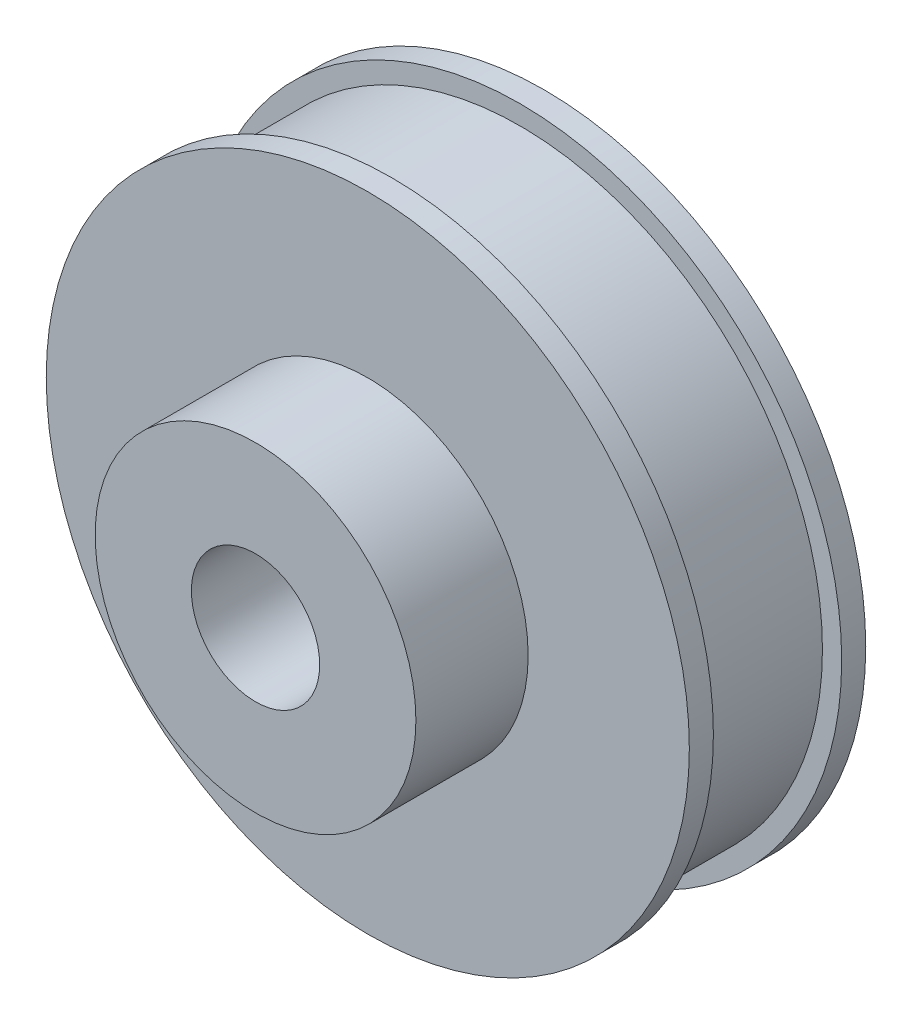
ISO-10303-21;
HEADER;
FILE_DESCRIPTION(('STEP AP214'),'2;1');
FILE_NAME('part.step','',(''),(''),'','','');
FILE_SCHEMA(('AUTOMOTIVE_DESIGN { 1 0 10303 214 1 1 1 1 }'));
ENDSEC;
DATA;
#1=APPLICATION_CONTEXT('core data for automotive mechanical design processes');
#2=APPLICATION_PROTOCOL_DEFINITION('international standard','automotive_design',2000,#1);
#3=PRODUCT_CONTEXT('',#1,'mechanical');
#4=PRODUCT('Part','Part','',(#3));
#5=PRODUCT_RELATED_PRODUCT_CATEGORY('part','',(#4));
#6=PRODUCT_DEFINITION_FORMATION('','',#4);
#7=PRODUCT_DEFINITION_CONTEXT('part definition',#1,'design');
#8=PRODUCT_DEFINITION('design','',#6,#7);
#9=PRODUCT_DEFINITION_SHAPE('','',#8);
#10=(LENGTH_UNIT() NAMED_UNIT(*) SI_UNIT(.MILLI.,.METRE.));
#11=(NAMED_UNIT(*) PLANE_ANGLE_UNIT() SI_UNIT($,.RADIAN.));
#12=(NAMED_UNIT(*) SI_UNIT($,.STERADIAN.) SOLID_ANGLE_UNIT());
#13=UNCERTAINTY_MEASURE_WITH_UNIT(LENGTH_MEASURE(1.E-05),#10,'distance_accuracy_value','');
#14=(GEOMETRIC_REPRESENTATION_CONTEXT(3) GLOBAL_UNCERTAINTY_ASSIGNED_CONTEXT((#13)) GLOBAL_UNIT_ASSIGNED_CONTEXT((#10,
#11,#12)) REPRESENTATION_CONTEXT('',''));
#15=CARTESIAN_POINT('',(0.,0.,0.));
#16=DIRECTION('',(0.,0.,1.));
#17=DIRECTION('',(1.,0.,0.));
#18=AXIS2_PLACEMENT_3D('',#15,#16,#17);
#19=CARTESIAN_POINT('',(0.,0.,11.));
#20=DIRECTION('',(0.,0.,-1.));
#21=DIRECTION('',(-1.,0.,0.));
#22=AXIS2_PLACEMENT_3D('',#19,#20,#21);
#23=CYLINDRICAL_SURFACE('',#22,18.85);
#24=CARTESIAN_POINT('',(0.,0.,1.5));
#25=DIRECTION('',(0.,0.,1.));
#26=DIRECTION('',(1.,0.,0.));
#27=AXIS2_PLACEMENT_3D('',#24,#25,#26);
#28=CIRCLE('',#27,18.85);
#29=CARTESIAN_POINT('',(18.85,0.,1.5));
#30=VERTEX_POINT('',#29);
#31=EDGE_CURVE('E46',#30,#30,#28,.T.);
#32=ORIENTED_EDGE('',*,*,#31,.T.);
#33=EDGE_LOOP('',(#32));
#34=FACE_BOUND('',#33,.T.);
#35=CARTESIAN_POINT('',(0.,0.,9.5));
#36=DIRECTION('',(0.,0.,1.));
#37=DIRECTION('',(1.,0.,0.));
#38=AXIS2_PLACEMENT_3D('',#35,#36,#37);
#39=CIRCLE('',#38,18.85);
#40=CARTESIAN_POINT('',(18.85,0.,9.5));
#41=VERTEX_POINT('',#40);
#42=EDGE_CURVE('E10',#41,#41,#39,.T.);
#43=ORIENTED_EDGE('',*,*,#42,.F.);
#44=EDGE_LOOP('',(#43));
#45=FACE_BOUND('',#44,.T.);
#46=ADVANCED_FACE('F32',(#34,#45),#23,.T.);
#47=CARTESIAN_POINT('',(0.,0.,11.));
#48=DIRECTION('',(0.,0.,-1.));
#49=DIRECTION('',(-1.,0.,0.));
#50=AXIS2_PLACEMENT_3D('',#47,#48,#49);
#51=CYLINDRICAL_SURFACE('',#50,4.);
#52=CARTESIAN_POINT('',(0.,0.,0.));
#53=DIRECTION('',(0.,0.,1.));
#54=DIRECTION('',(1.,0.,0.));
#55=AXIS2_PLACEMENT_3D('',#52,#53,#54);
#56=CIRCLE('',#55,4.);
#57=CARTESIAN_POINT('',(4.,0.,0.));
#58=VERTEX_POINT('',#57);
#59=EDGE_CURVE('E38',#58,#58,#56,.T.);
#60=ORIENTED_EDGE('',*,*,#59,.F.);
#61=EDGE_LOOP('',(#60));
#62=FACE_BOUND('',#61,.T.);
#63=CARTESIAN_POINT('',(0.,0.,18.));
#64=DIRECTION('',(0.,0.,1.));
#65=DIRECTION('',(1.,0.,0.));
#66=AXIS2_PLACEMENT_3D('',#63,#64,#65);
#67=CIRCLE('',#66,4.);
#68=CARTESIAN_POINT('',(4.,0.,18.));
#69=VERTEX_POINT('',#68);
#70=EDGE_CURVE('E66',#69,#69,#67,.T.);
#71=ORIENTED_EDGE('',*,*,#70,.T.);
#72=EDGE_LOOP('',(#71));
#73=FACE_BOUND('',#72,.T.);
#74=ADVANCED_FACE('F70',(#62,#73),#51,.F.);
#75=CARTESIAN_POINT('',(0.,0.,11.));
#76=DIRECTION('',(0.,0.,1.));
#77=DIRECTION('',(1.,0.,0.));
#78=AXIS2_PLACEMENT_3D('',#75,#76,#77);
#79=PLANE('',#78);
#80=CARTESIAN_POINT('',(0.,0.,11.));
#81=DIRECTION('',(0.,0.,1.));
#82=DIRECTION('',(1.,0.,0.));
#83=AXIS2_PLACEMENT_3D('',#80,#81,#82);
#84=CIRCLE('',#83,10.);
#85=CARTESIAN_POINT('',(10.,0.,11.));
#86=VERTEX_POINT('',#85);
#87=EDGE_CURVE('E58',#86,#86,#84,.F.);
#88=ORIENTED_EDGE('',*,*,#87,.T.);
#89=EDGE_LOOP('',(#88));
#90=FACE_BOUND('',#89,.T.);
#91=CARTESIAN_POINT('',(0.,0.,11.));
#92=DIRECTION('',(0.,0.,1.));
#93=DIRECTION('',(1.,0.,0.));
#94=AXIS2_PLACEMENT_3D('',#91,#92,#93);
#95=CIRCLE('',#94,20.05);
#96=CARTESIAN_POINT('',(20.05,0.,11.));
#97=VERTEX_POINT('',#96);
#98=EDGE_CURVE('E55',#97,#97,#95,.T.);
#99=ORIENTED_EDGE('',*,*,#98,.T.);
#100=EDGE_LOOP('',(#99));
#101=FACE_BOUND('',#100,.T.);
#102=ADVANCED_FACE('F94',(#90,#101),#79,.T.);
#103=CARTESIAN_POINT('',(0.,0.,0.));
#104=DIRECTION('',(0.,0.,1.));
#105=DIRECTION('',(1.,0.,0.));
#106=AXIS2_PLACEMENT_3D('',#103,#104,#105);
#107=PLANE('',#106);
#108=CARTESIAN_POINT('',(0.,0.,0.));
#109=DIRECTION('',(0.,0.,1.));
#110=DIRECTION('',(1.,0.,0.));
#111=AXIS2_PLACEMENT_3D('',#108,#109,#110);
#112=CIRCLE('',#111,20.05);
#113=CARTESIAN_POINT('',(20.05,0.,0.));
#114=VERTEX_POINT('',#113);
#115=EDGE_CURVE('E49',#114,#114,#112,.T.);
#116=ORIENTED_EDGE('',*,*,#115,.F.);
#117=EDGE_LOOP('',(#116));
#118=FACE_BOUND('',#117,.T.);
#119=ORIENTED_EDGE('',*,*,#59,.T.);
#120=EDGE_LOOP('',(#119));
#121=FACE_BOUND('',#120,.T.);
#122=ADVANCED_FACE('F108',(#118,#121),#107,.F.);
#123=CARTESIAN_POINT('',(0.,0.,1.5));
#124=DIRECTION('',(0.,0.,-1.));
#125=DIRECTION('',(-1.,0.,0.));
#126=AXIS2_PLACEMENT_3D('',#123,#124,#125);
#127=CYLINDRICAL_SURFACE('',#126,20.05);
#128=CARTESIAN_POINT('',(0.,0.,1.5));
#129=DIRECTION('',(0.,0.,1.));
#130=DIRECTION('',(1.,0.,0.));
#131=AXIS2_PLACEMENT_3D('',#128,#129,#130);
#132=CIRCLE('',#131,20.05);
#133=CARTESIAN_POINT('',(20.05,0.,1.5));
#134=VERTEX_POINT('',#133);
#135=EDGE_CURVE('E42',#134,#134,#132,.T.);
#136=ORIENTED_EDGE('',*,*,#135,.F.);
#137=EDGE_LOOP('',(#136));
#138=FACE_BOUND('',#137,.T.);
#139=ORIENTED_EDGE('',*,*,#115,.T.);
#140=EDGE_LOOP('',(#139));
#141=FACE_BOUND('',#140,.T.);
#142=ADVANCED_FACE('F102',(#138,#141),#127,.T.);
#143=CARTESIAN_POINT('',(0.,0.,1.5));
#144=DIRECTION('',(0.,0.,1.));
#145=DIRECTION('',(1.,0.,0.));
#146=AXIS2_PLACEMENT_3D('',#143,#144,#145);
#147=PLANE('',#146);
#148=ORIENTED_EDGE('',*,*,#31,.F.);
#149=EDGE_LOOP('',(#148));
#150=FACE_BOUND('',#149,.T.);
#151=ORIENTED_EDGE('',*,*,#135,.T.);
#152=EDGE_LOOP('',(#151));
#153=FACE_BOUND('',#152,.T.);
#154=ADVANCED_FACE('F99',(#150,#153),#147,.T.);
#155=CARTESIAN_POINT('',(0.,0.,9.5));
#156=DIRECTION('',(0.,0.,1.));
#157=DIRECTION('',(1.,0.,0.));
#158=AXIS2_PLACEMENT_3D('',#155,#156,#157);
#159=CYLINDRICAL_SURFACE('',#158,20.05);
#160=CARTESIAN_POINT('',(0.,0.,9.5));
#161=DIRECTION('',(0.,0.,1.));
#162=DIRECTION('',(1.,0.,0.));
#163=AXIS2_PLACEMENT_3D('',#160,#161,#162);
#164=CIRCLE('',#163,20.05);
#165=CARTESIAN_POINT('',(20.05,0.,9.5));
#166=VERTEX_POINT('',#165);
#167=EDGE_CURVE('E51',#166,#166,#164,.T.);
#168=ORIENTED_EDGE('',*,*,#167,.T.);
#169=EDGE_LOOP('',(#168));
#170=FACE_BOUND('',#169,.T.);
#171=ORIENTED_EDGE('',*,*,#98,.F.);
#172=EDGE_LOOP('',(#171));
#173=FACE_BOUND('',#172,.T.);
#174=ADVANCED_FACE('F86',(#170,#173),#159,.T.);
#175=CARTESIAN_POINT('',(0.,0.,9.5));
#176=DIRECTION('',(0.,0.,1.));
#177=DIRECTION('',(1.,0.,0.));
#178=AXIS2_PLACEMENT_3D('',#175,#176,#177);
#179=PLANE('',#178);
#180=ORIENTED_EDGE('',*,*,#42,.T.);
#181=EDGE_LOOP('',(#180));
#182=FACE_BOUND('',#181,.T.);
#183=ORIENTED_EDGE('',*,*,#167,.F.);
#184=EDGE_LOOP('',(#183));
#185=FACE_BOUND('',#184,.T.);
#186=ADVANCED_FACE('F80',(#182,#185),#179,.F.);
#187=CARTESIAN_POINT('',(0.,0.,18.));
#188=DIRECTION('',(0.,0.,-1.));
#189=DIRECTION('',(-1.,0.,0.));
#190=AXIS2_PLACEMENT_3D('',#187,#188,#189);
#191=CYLINDRICAL_SURFACE('',#190,10.);
#192=ORIENTED_EDGE('',*,*,#87,.F.);
#193=EDGE_LOOP('',(#192));
#194=FACE_BOUND('',#193,.T.);
#195=CARTESIAN_POINT('',(0.,0.,18.));
#196=DIRECTION('',(0.,0.,1.));
#197=DIRECTION('',(1.,0.,0.));
#198=AXIS2_PLACEMENT_3D('',#195,#196,#197);
#199=CIRCLE('',#198,10.);
#200=CARTESIAN_POINT('',(10.,0.,18.));
#201=VERTEX_POINT('',#200);
#202=EDGE_CURVE('E63',#201,#201,#199,.T.);
#203=ORIENTED_EDGE('',*,*,#202,.F.);
#204=EDGE_LOOP('',(#203));
#205=FACE_BOUND('',#204,.T.);
#206=ADVANCED_FACE('F75',(#194,#205),#191,.T.);
#207=CARTESIAN_POINT('',(0.,0.,18.));
#208=DIRECTION('',(0.,0.,1.));
#209=DIRECTION('',(1.,0.,0.));
#210=AXIS2_PLACEMENT_3D('',#207,#208,#209);
#211=PLANE('',#210);
#212=ORIENTED_EDGE('',*,*,#70,.F.);
#213=EDGE_LOOP('',(#212));
#214=FACE_BOUND('',#213,.T.);
#215=ORIENTED_EDGE('',*,*,#202,.T.);
#216=EDGE_LOOP('',(#215));
#217=FACE_BOUND('',#216,.T.);
#218=ADVANCED_FACE('F72',(#214,#217),#211,.T.);
#219=CLOSED_SHELL('',(#46,#74,#102,#122,#142,#154,#174,#186,#206,#218));
#220=MANIFOLD_SOLID_BREP('B2',#219);
#221=ADVANCED_BREP_SHAPE_REPRESENTATION('',(#18,#220),#14);
#222=SHAPE_DEFINITION_REPRESENTATION(#9,#221);
ENDSEC;
END-ISO-10303-21;
